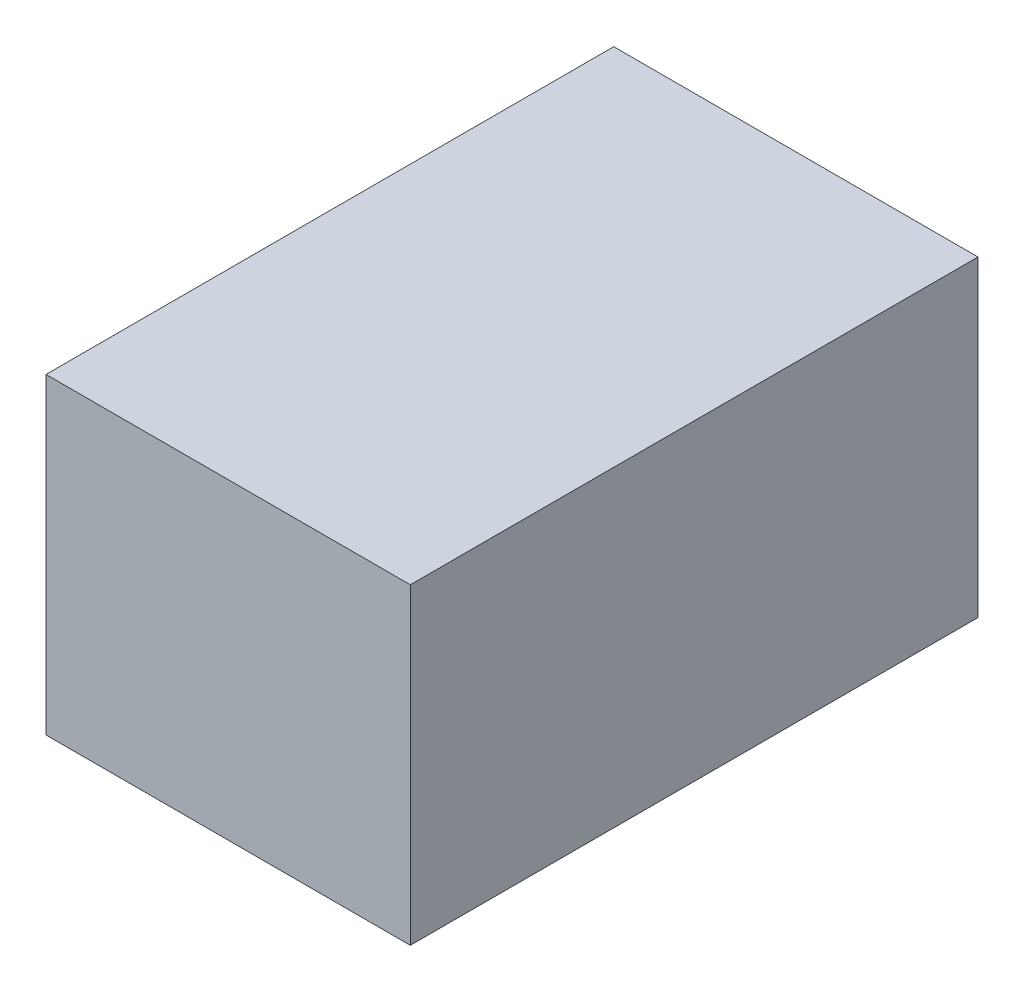
ISO-10303-21;
HEADER;
FILE_DESCRIPTION(('STEP AP214'),'2;1');
FILE_NAME('part.step','',(''),(''),'','','');
FILE_SCHEMA(('AUTOMOTIVE_DESIGN { 1 0 10303 214 1 1 1 1 }'));
ENDSEC;
DATA;
#1=APPLICATION_CONTEXT('core data for automotive mechanical design processes');
#2=APPLICATION_PROTOCOL_DEFINITION('international standard','automotive_design',2000,#1);
#3=PRODUCT_CONTEXT('',#1,'mechanical');
#4=PRODUCT('Part','Part','',(#3));
#5=PRODUCT_RELATED_PRODUCT_CATEGORY('part','',(#4));
#6=PRODUCT_DEFINITION_FORMATION('','',#4);
#7=PRODUCT_DEFINITION_CONTEXT('part definition',#1,'design');
#8=PRODUCT_DEFINITION('design','',#6,#7);
#9=PRODUCT_DEFINITION_SHAPE('','',#8);
#10=(LENGTH_UNIT() NAMED_UNIT(*) SI_UNIT(.MILLI.,.METRE.));
#11=(NAMED_UNIT(*) PLANE_ANGLE_UNIT() SI_UNIT($,.RADIAN.));
#12=(NAMED_UNIT(*) SI_UNIT($,.STERADIAN.) SOLID_ANGLE_UNIT());
#13=UNCERTAINTY_MEASURE_WITH_UNIT(LENGTH_MEASURE(1.E-05),#10,'distance_accuracy_value','');
#14=(GEOMETRIC_REPRESENTATION_CONTEXT(3) GLOBAL_UNCERTAINTY_ASSIGNED_CONTEXT((#13)) GLOBAL_UNIT_ASSIGNED_CONTEXT((#10,
#11,#12)) REPRESENTATION_CONTEXT('',''));
#15=CARTESIAN_POINT('',(0.,0.,0.));
#16=DIRECTION('',(0.,0.,1.));
#17=DIRECTION('',(1.,0.,0.));
#18=AXIS2_PLACEMENT_3D('',#15,#16,#17);
#19=CARTESIAN_POINT('',(-72.5266072891073,-1.38939393939394,120.));
#20=DIRECTION('',(1.,0.,0.));
#21=DIRECTION('',(0.,0.,-1.));
#22=AXIS2_PLACEMENT_3D('',#19,#20,#21);
#23=PLANE('',#22);
#24=DIRECTION('',(0.,-1.,0.));
#25=VECTOR('',#24,1.);
#26=CARTESIAN_POINT('',(-72.5266072891073,-1.38939393939394,0.));
#27=LINE('',#26,#25);
#28=CARTESIAN_POINT('',(-72.5266072891073,64.6106060606061,0.));
#29=VERTEX_POINT('',#28);
#30=CARTESIAN_POINT('',(-72.5266072891073,-1.38939393939394,0.));
#31=VERTEX_POINT('',#30);
#32=EDGE_CURVE('E96',#29,#31,#27,.T.);
#33=ORIENTED_EDGE('',*,*,#32,.T.);
#34=DIRECTION('',(0.,0.,-1.));
#35=VECTOR('',#34,1.);
#36=CARTESIAN_POINT('',(-72.5266072891073,-1.38939393939394,120.));
#37=LINE('',#36,#35);
#38=CARTESIAN_POINT('',(-72.5266072891073,-1.38939393939394,120.));
#39=VERTEX_POINT('',#38);
#40=EDGE_CURVE('E11',#39,#31,#37,.T.);
#41=ORIENTED_EDGE('',*,*,#40,.F.);
#42=DIRECTION('',(0.,-1.,0.));
#43=VECTOR('',#42,1.);
#44=CARTESIAN_POINT('',(-72.5266072891073,-1.38939393939394,120.));
#45=LINE('',#44,#43);
#46=CARTESIAN_POINT('',(-72.5266072891073,64.6106060606061,120.));
#47=VERTEX_POINT('',#46);
#48=EDGE_CURVE('E84',#47,#39,#45,.T.);
#49=ORIENTED_EDGE('',*,*,#48,.F.);
#50=DIRECTION('',(0.,0.,-1.));
#51=VECTOR('',#50,1.);
#52=CARTESIAN_POINT('',(-72.5266072891073,64.6106060606061,120.));
#53=LINE('',#52,#51);
#54=EDGE_CURVE('E92',#47,#29,#53,.T.);
#55=ORIENTED_EDGE('',*,*,#54,.T.);
#56=EDGE_LOOP('',(#33,#41,#49,#55));
#57=FACE_BOUND('',#56,.T.);
#58=ADVANCED_FACE('F33',(#57),#23,.F.);
#59=CARTESIAN_POINT('',(-72.5266072891073,-1.38939393939394,120.));
#60=DIRECTION('',(0.,1.,0.));
#61=DIRECTION('',(0.,0.,1.));
#62=AXIS2_PLACEMENT_3D('',#59,#60,#61);
#63=PLANE('',#62);
#64=DIRECTION('',(1.,0.,0.));
#65=VECTOR('',#64,1.);
#66=CARTESIAN_POINT('',(-72.5266072891073,-1.38939393939394,0.));
#67=LINE('',#66,#65);
#68=CARTESIAN_POINT('',(4.47339271089271,-1.38939393939394,0.));
#69=VERTEX_POINT('',#68);
#70=EDGE_CURVE('E88',#31,#69,#67,.T.);
#71=ORIENTED_EDGE('',*,*,#70,.T.);
#72=DIRECTION('',(0.,0.,-1.));
#73=VECTOR('',#72,1.);
#74=CARTESIAN_POINT('',(4.47339271089271,-1.38939393939394,120.));
#75=LINE('',#74,#73);
#76=CARTESIAN_POINT('',(4.47339271089271,-1.38939393939394,120.));
#77=VERTEX_POINT('',#76);
#78=EDGE_CURVE('E41',#77,#69,#75,.T.);
#79=ORIENTED_EDGE('',*,*,#78,.F.);
#80=DIRECTION('',(1.,0.,0.));
#81=VECTOR('',#80,1.);
#82=CARTESIAN_POINT('',(-72.5266072891073,-1.38939393939394,120.));
#83=LINE('',#82,#81);
#84=EDGE_CURVE('E79',#39,#77,#83,.T.);
#85=ORIENTED_EDGE('',*,*,#84,.F.);
#86=ORIENTED_EDGE('',*,*,#40,.T.);
#87=EDGE_LOOP('',(#71,#79,#85,#86));
#88=FACE_BOUND('',#87,.T.);
#89=ADVANCED_FACE('F87',(#88),#63,.F.);
#90=CARTESIAN_POINT('',(4.47339271089271,-1.38939393939394,120.));
#91=DIRECTION('',(-1.,0.,0.));
#92=DIRECTION('',(0.,0.,1.));
#93=AXIS2_PLACEMENT_3D('',#90,#91,#92);
#94=PLANE('',#93);
#95=DIRECTION('',(0.,1.,0.));
#96=VECTOR('',#95,1.);
#97=CARTESIAN_POINT('',(4.47339271089271,-1.38939393939394,0.));
#98=LINE('',#97,#96);
#99=CARTESIAN_POINT('',(4.47339271089271,64.6106060606061,0.));
#100=VERTEX_POINT('',#99);
#101=EDGE_CURVE('E66',#69,#100,#98,.T.);
#102=ORIENTED_EDGE('',*,*,#101,.T.);
#103=DIRECTION('',(0.,0.,-1.));
#104=VECTOR('',#103,1.);
#105=CARTESIAN_POINT('',(4.47339271089271,64.6106060606061,120.));
#106=LINE('',#105,#104);
#107=CARTESIAN_POINT('',(4.47339271089271,64.6106060606061,120.));
#108=VERTEX_POINT('',#107);
#109=EDGE_CURVE('E89',#108,#100,#106,.T.);
#110=ORIENTED_EDGE('',*,*,#109,.F.);
#111=DIRECTION('',(0.,1.,0.));
#112=VECTOR('',#111,1.);
#113=CARTESIAN_POINT('',(4.47339271089271,-1.38939393939394,120.));
#114=LINE('',#113,#112);
#115=EDGE_CURVE('E82',#77,#108,#114,.T.);
#116=ORIENTED_EDGE('',*,*,#115,.F.);
#117=ORIENTED_EDGE('',*,*,#78,.T.);
#118=EDGE_LOOP('',(#102,#110,#116,#117));
#119=FACE_BOUND('',#118,.T.);
#120=ADVANCED_FACE('F90',(#119),#94,.F.);
#121=CARTESIAN_POINT('',(-72.5266072891073,64.6106060606061,120.));
#122=DIRECTION('',(0.,-1.,0.));
#123=DIRECTION('',(0.,0.,-1.));
#124=AXIS2_PLACEMENT_3D('',#121,#122,#123);
#125=PLANE('',#124);
#126=DIRECTION('',(-1.,0.,0.));
#127=VECTOR('',#126,1.);
#128=CARTESIAN_POINT('',(-72.5266072891073,64.6106060606061,0.));
#129=LINE('',#128,#127);
#130=EDGE_CURVE('E72',#100,#29,#129,.T.);
#131=ORIENTED_EDGE('',*,*,#130,.T.);
#132=ORIENTED_EDGE('',*,*,#54,.F.);
#133=DIRECTION('',(-1.,0.,0.));
#134=VECTOR('',#133,1.);
#135=CARTESIAN_POINT('',(-72.5266072891073,64.6106060606061,120.));
#136=LINE('',#135,#134);
#137=EDGE_CURVE('E49',#108,#47,#136,.T.);
#138=ORIENTED_EDGE('',*,*,#137,.F.);
#139=ORIENTED_EDGE('',*,*,#109,.T.);
#140=EDGE_LOOP('',(#131,#132,#138,#139));
#141=FACE_BOUND('',#140,.T.);
#142=ADVANCED_FACE('F103',(#141),#125,.F.);
#143=CARTESIAN_POINT('',(0.,0.,120.));
#144=DIRECTION('',(0.,0.,-1.));
#145=DIRECTION('',(-1.,0.,0.));
#146=AXIS2_PLACEMENT_3D('',#143,#144,#145);
#147=PLANE('',#146);
#148=ORIENTED_EDGE('',*,*,#48,.T.);
#149=ORIENTED_EDGE('',*,*,#84,.T.);
#150=ORIENTED_EDGE('',*,*,#115,.T.);
#151=ORIENTED_EDGE('',*,*,#137,.T.);
#152=EDGE_LOOP('',(#148,#149,#150,#151));
#153=FACE_BOUND('',#152,.T.);
#154=ADVANCED_FACE('F80',(#153),#147,.F.);
#155=CARTESIAN_POINT('',(0.,0.,0.));
#156=DIRECTION('',(0.,0.,-1.));
#157=DIRECTION('',(-1.,0.,0.));
#158=AXIS2_PLACEMENT_3D('',#155,#156,#157);
#159=PLANE('',#158);
#160=ORIENTED_EDGE('',*,*,#32,.F.);
#161=ORIENTED_EDGE('',*,*,#130,.F.);
#162=ORIENTED_EDGE('',*,*,#101,.F.);
#163=ORIENTED_EDGE('',*,*,#70,.F.);
#164=EDGE_LOOP('',(#160,#161,#162,#163));
#165=FACE_BOUND('',#164,.T.);
#166=ADVANCED_FACE('F106',(#165),#159,.T.);
#167=CLOSED_SHELL('',(#58,#89,#120,#142,#154,#166));
#168=MANIFOLD_SOLID_BREP('B2',#167);
#169=ADVANCED_BREP_SHAPE_REPRESENTATION('',(#18,#168),#14);
#170=SHAPE_DEFINITION_REPRESENTATION(#9,#169);
ENDSEC;
END-ISO-10303-21;
